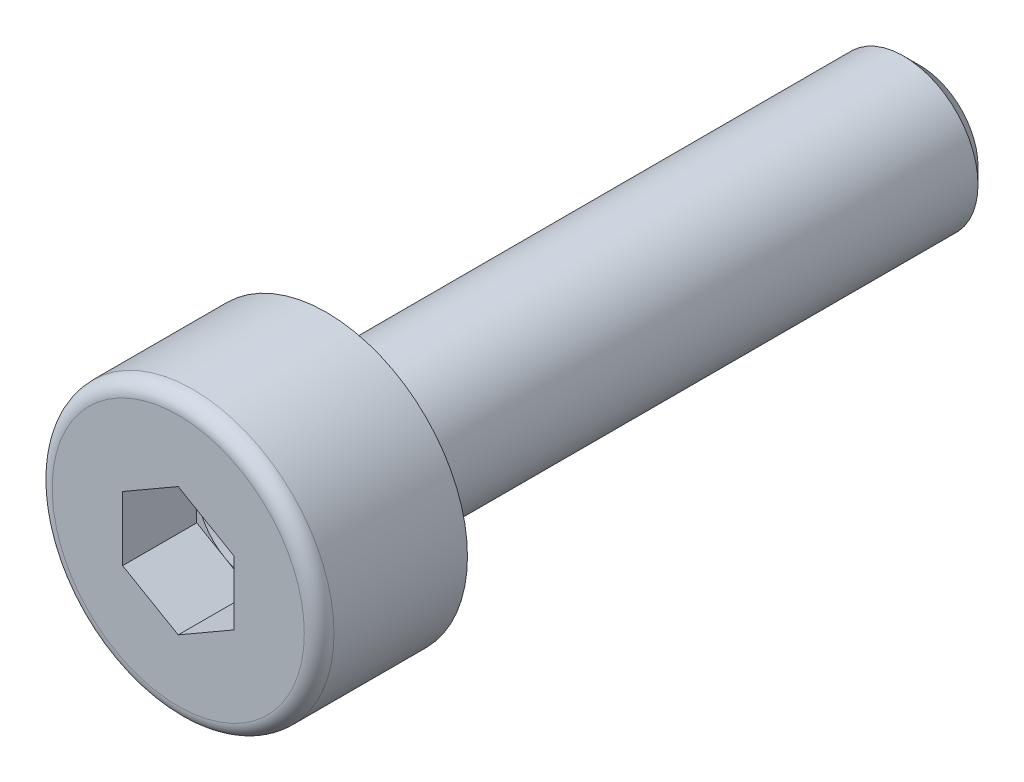
ISO-10303-21;
HEADER;
FILE_DESCRIPTION(('STEP AP214'),'2;1');
FILE_NAME('part.step','',(''),(''),'','','');
FILE_SCHEMA(('AUTOMOTIVE_DESIGN { 1 0 10303 214 1 1 1 1 }'));
ENDSEC;
DATA;
#1=APPLICATION_CONTEXT('core data for automotive mechanical design processes');
#2=APPLICATION_PROTOCOL_DEFINITION('international standard','automotive_design',2000,#1);
#3=PRODUCT_CONTEXT('',#1,'mechanical');
#4=PRODUCT('Part','Part','',(#3));
#5=PRODUCT_RELATED_PRODUCT_CATEGORY('part','',(#4));
#6=PRODUCT_DEFINITION_FORMATION('','',#4);
#7=PRODUCT_DEFINITION_CONTEXT('part definition',#1,'design');
#8=PRODUCT_DEFINITION('design','',#6,#7);
#9=PRODUCT_DEFINITION_SHAPE('','',#8);
#10=(LENGTH_UNIT() NAMED_UNIT(*) SI_UNIT(.MILLI.,.METRE.));
#11=(NAMED_UNIT(*) PLANE_ANGLE_UNIT() SI_UNIT($,.RADIAN.));
#12=(NAMED_UNIT(*) SI_UNIT($,.STERADIAN.) SOLID_ANGLE_UNIT());
#13=UNCERTAINTY_MEASURE_WITH_UNIT(LENGTH_MEASURE(1.E-05),#10,'distance_accuracy_value','');
#14=(GEOMETRIC_REPRESENTATION_CONTEXT(3) GLOBAL_UNCERTAINTY_ASSIGNED_CONTEXT((#13)) GLOBAL_UNIT_ASSIGNED_CONTEXT((#10,
#11,#12)) REPRESENTATION_CONTEXT('',''));
#15=CARTESIAN_POINT('',(0.,0.,0.));
#16=DIRECTION('',(0.,0.,1.));
#17=DIRECTION('',(1.,0.,0.));
#18=AXIS2_PLACEMENT_3D('',#15,#16,#17);
#19=CARTESIAN_POINT('',(0.,0.,-1.));
#20=DIRECTION('',(0.,0.,1.));
#21=DIRECTION('',(1.,0.,0.));
#22=AXIS2_PLACEMENT_3D('',#19,#20,#21);
#23=PLANE('',#22);
#24=DIRECTION('',(0.,1.,0.));
#25=VECTOR('',#24,1.);
#26=CARTESIAN_POINT('',(-0.75,0.094096357056681,-1.));
#27=LINE('',#26,#25);
#28=CARTESIAN_POINT('',(-0.75,0.,-1.));
#29=VERTEX_POINT('',#28);
#30=CARTESIAN_POINT('',(-0.75,0.433012701892219,-1.));
#31=VERTEX_POINT('',#30);
#32=EDGE_CURVE('E289',#29,#31,#27,.T.);
#33=ORIENTED_EDGE('',*,*,#32,.F.);
#34=CARTESIAN_POINT('',(0.,0.,-1.));
#35=DIRECTION('',(0.,0.,-1.));
#36=DIRECTION('',(-1.,0.,0.));
#37=AXIS2_PLACEMENT_3D('',#34,#35,#36);
#38=CIRCLE('',#37,0.75);
#39=CARTESIAN_POINT('',(-0.375,0.649519052838329,-1.));
#40=VERTEX_POINT('',#39);
#41=EDGE_CURVE('E38',#29,#40,#38,.T.);
#42=ORIENTED_EDGE('',*,*,#41,.T.);
#43=DIRECTION('',(0.866025403784439,0.5,0.));
#44=VECTOR('',#43,1.);
#45=CARTESIAN_POINT('',(-0.367562637900043,0.6538130158488,-1.));
#46=LINE('',#45,#44);
#47=EDGE_CURVE('E290',#31,#40,#46,.T.);
#48=ORIENTED_EDGE('',*,*,#47,.F.);
#49=EDGE_LOOP('',(#33,#42,#48));
#50=FACE_BOUND('',#49,.T.);
#51=ADVANCED_FACE('F17',(#50),#23,.T.);
#52=CARTESIAN_POINT('',(0.,0.866025403784439,-1.));
#53=VERTEX_POINT('',#52);
#54=EDGE_CURVE('E294',#40,#53,#46,.T.);
#55=ORIENTED_EDGE('',*,*,#54,.F.);
#56=CARTESIAN_POINT('',(0.375,0.649519052838329,-1.));
#57=VERTEX_POINT('',#56);
#58=EDGE_CURVE('E305',#40,#57,#38,.T.);
#59=ORIENTED_EDGE('',*,*,#58,.T.);
#60=DIRECTION('',(0.866025403784439,-0.5,0.));
#61=VECTOR('',#60,1.);
#62=CARTESIAN_POINT('',(0.421958339069536,0.622407643135835,-1.));
#63=LINE('',#62,#61);
#64=EDGE_CURVE('E295',#53,#57,#63,.T.);
#65=ORIENTED_EDGE('',*,*,#64,.F.);
#66=EDGE_LOOP('',(#55,#59,#65));
#67=FACE_BOUND('',#66,.T.);
#68=ADVANCED_FACE('F134',(#67),#23,.T.);
#69=CARTESIAN_POINT('',(0.75,0.43301270189222,-1.));
#70=VERTEX_POINT('',#69);
#71=EDGE_CURVE('E299',#57,#70,#63,.T.);
#72=ORIENTED_EDGE('',*,*,#71,.F.);
#73=CARTESIAN_POINT('',(0.75,0.,-1.));
#74=VERTEX_POINT('',#73);
#75=EDGE_CURVE('E313',#57,#74,#38,.T.);
#76=ORIENTED_EDGE('',*,*,#75,.T.);
#77=DIRECTION('',(0.,-1.,0.));
#78=VECTOR('',#77,1.);
#79=CARTESIAN_POINT('',(0.75,-0.146115026256323,-1.));
#80=LINE('',#79,#78);
#81=EDGE_CURVE('E300',#70,#74,#80,.T.);
#82=ORIENTED_EDGE('',*,*,#81,.F.);
#83=EDGE_LOOP('',(#72,#76,#82));
#84=FACE_BOUND('',#83,.T.);
#85=ADVANCED_FACE('F139',(#84),#23,.T.);
#86=CARTESIAN_POINT('',(0.75,-0.43301270189222,-1.));
#87=VERTEX_POINT('',#86);
#88=EDGE_CURVE('E257',#74,#87,#80,.T.);
#89=ORIENTED_EDGE('',*,*,#88,.F.);
#90=CARTESIAN_POINT('',(0.375,-0.649519052838329,-1.));
#91=VERTEX_POINT('',#90);
#92=EDGE_CURVE('E321',#74,#91,#38,.T.);
#93=ORIENTED_EDGE('',*,*,#92,.T.);
#94=DIRECTION('',(-0.866025403784439,-0.5,0.));
#95=VECTOR('',#94,1.);
#96=CARTESIAN_POINT('',(0.346250214161918,-0.66611774943109,-1.));
#97=LINE('',#96,#95);
#98=EDGE_CURVE('E252',#87,#91,#97,.T.);
#99=ORIENTED_EDGE('',*,*,#98,.F.);
#100=EDGE_LOOP('',(#89,#93,#99));
#101=FACE_BOUND('',#100,.T.);
#102=ADVANCED_FACE('F338',(#101),#23,.T.);
#103=CARTESIAN_POINT('',(0.,-0.866025403784439,-1.));
#104=VERTEX_POINT('',#103);
#105=EDGE_CURVE('E279',#91,#104,#97,.T.);
#106=ORIENTED_EDGE('',*,*,#105,.F.);
#107=CARTESIAN_POINT('',(-0.375,-0.649519052838329,-1.));
#108=VERTEX_POINT('',#107);
#109=EDGE_CURVE('E314',#91,#108,#38,.T.);
#110=ORIENTED_EDGE('',*,*,#109,.T.);
#111=DIRECTION('',(-0.866025403784439,0.5,0.));
#112=VECTOR('',#111,1.);
#113=CARTESIAN_POINT('',(-0.0688822646431522,-0.826256209750324,-1.));
#114=LINE('',#113,#112);
#115=EDGE_CURVE('E280',#104,#108,#114,.T.);
#116=ORIENTED_EDGE('',*,*,#115,.F.);
#117=EDGE_LOOP('',(#106,#110,#116));
#118=FACE_BOUND('',#117,.T.);
#119=ADVANCED_FACE('F132',(#118),#23,.T.);
#120=CARTESIAN_POINT('',(-1.10172582585694,0.,0.));
#121=DIRECTION('',(0.,0.,-1.));
#122=DIRECTION('',(-1.,0.,0.));
#123=AXIS2_PLACEMENT_3D('',#120,#121,#122);
#124=PLANE('',#123);
#125=CARTESIAN_POINT('',(0.,0.,0.));
#126=DIRECTION('',(0.,0.,1.));
#127=DIRECTION('',(1.,0.,0.));
#128=AXIS2_PLACEMENT_3D('',#125,#126,#127);
#129=CIRCLE('',#128,1.7);
#130=CARTESIAN_POINT('',(1.7,0.,0.));
#131=VERTEX_POINT('',#130);
#132=EDGE_CURVE('E222',#131,#131,#129,.T.);
#133=ORIENTED_EDGE('',*,*,#132,.T.);
#134=EDGE_LOOP('',(#133));
#135=FACE_BOUND('',#134,.T.);
#136=DIRECTION('',(0.,-1.,0.));
#137=VECTOR('',#136,1.);
#138=CARTESIAN_POINT('',(0.75,-0.146115026256323,0.));
#139=LINE('',#138,#137);
#140=CARTESIAN_POINT('',(0.75,0.43301270189222,0.));
#141=VERTEX_POINT('',#140);
#142=CARTESIAN_POINT('',(0.75,-0.43301270189222,0.));
#143=VERTEX_POINT('',#142);
#144=EDGE_CURVE('E272',#141,#143,#139,.T.);
#145=ORIENTED_EDGE('',*,*,#144,.T.);
#146=DIRECTION('',(-0.866025403784439,-0.5,0.));
#147=VECTOR('',#146,1.);
#148=CARTESIAN_POINT('',(0.346250214161918,-0.66611774943109,0.));
#149=LINE('',#148,#147);
#150=CARTESIAN_POINT('',(0.,-0.866025403784439,0.));
#151=VERTEX_POINT('',#150);
#152=EDGE_CURVE('E253',#143,#151,#149,.T.);
#153=ORIENTED_EDGE('',*,*,#152,.T.);
#154=DIRECTION('',(-0.866025403784439,0.5,0.));
#155=VECTOR('',#154,1.);
#156=CARTESIAN_POINT('',(-0.0688822646431522,-0.826256209750324,0.));
#157=LINE('',#156,#155);
#158=CARTESIAN_POINT('',(-0.75,-0.43301270189222,0.));
#159=VERTEX_POINT('',#158);
#160=EDGE_CURVE('E50',#151,#159,#157,.T.);
#161=ORIENTED_EDGE('',*,*,#160,.T.);
#162=DIRECTION('',(0.,1.,0.));
#163=VECTOR('',#162,1.);
#164=CARTESIAN_POINT('',(-0.75,0.094096357056681,0.));
#165=LINE('',#164,#163);
#166=CARTESIAN_POINT('',(-0.75,0.433012701892219,0.));
#167=VERTEX_POINT('',#166);
#168=EDGE_CURVE('E260',#159,#167,#165,.T.);
#169=ORIENTED_EDGE('',*,*,#168,.T.);
#170=DIRECTION('',(0.866025403784439,0.5,0.));
#171=VECTOR('',#170,1.);
#172=CARTESIAN_POINT('',(-0.367562637900043,0.6538130158488,0.));
#173=LINE('',#172,#171);
#174=CARTESIAN_POINT('',(0.,0.866025403784439,0.));
#175=VERTEX_POINT('',#174);
#176=EDGE_CURVE('E264',#167,#175,#173,.T.);
#177=ORIENTED_EDGE('',*,*,#176,.T.);
#178=DIRECTION('',(0.866025403784439,-0.5,0.));
#179=VECTOR('',#178,1.);
#180=CARTESIAN_POINT('',(0.421958339069536,0.622407643135835,0.));
#181=LINE('',#180,#179);
#182=EDGE_CURVE('E268',#175,#141,#181,.T.);
#183=ORIENTED_EDGE('',*,*,#182,.T.);
#184=EDGE_LOOP('',(#145,#153,#161,#169,#177,#183));
#185=FACE_BOUND('',#184,.T.);
#186=ADVANCED_FACE('F184',(#135,#185),#124,.F.);
#187=CARTESIAN_POINT('',(0.,0.,-0.2));
#188=DIRECTION('',(0.,0.,1.));
#189=DIRECTION('',(1.,0.,0.));
#190=AXIS2_PLACEMENT_3D('',#187,#188,#189);
#191=TOROIDAL_SURFACE('',#190,1.7,0.2);
#192=CARTESIAN_POINT('',(0.,0.,-0.2));
#193=DIRECTION('',(0.,0.,1.));
#194=DIRECTION('',(1.,0.,0.));
#195=AXIS2_PLACEMENT_3D('',#192,#193,#194);
#196=CIRCLE('',#195,1.9);
#197=CARTESIAN_POINT('',(1.9,0.,-0.2));
#198=VERTEX_POINT('',#197);
#199=EDGE_CURVE('E226',#198,#198,#196,.T.);
#200=ORIENTED_EDGE('',*,*,#199,.T.);
#201=EDGE_LOOP('',(#200));
#202=FACE_BOUND('',#201,.T.);
#203=ORIENTED_EDGE('',*,*,#132,.F.);
#204=EDGE_LOOP('',(#203));
#205=FACE_BOUND('',#204,.T.);
#206=ADVANCED_FACE('F180',(#202,#205),#191,.T.);
#207=CARTESIAN_POINT('',(0.,0.,-5.));
#208=DIRECTION('',(0.,0.,1.));
#209=DIRECTION('',(1.,0.,0.));
#210=AXIS2_PLACEMENT_3D('',#207,#208,#209);
#211=CYLINDRICAL_SURFACE('',#210,1.9);
#212=ORIENTED_EDGE('',*,*,#199,.F.);
#213=EDGE_LOOP('',(#212));
#214=FACE_BOUND('',#213,.T.);
#215=CARTESIAN_POINT('',(0.,0.,-2.));
#216=DIRECTION('',(0.,0.,1.));
#217=DIRECTION('',(1.,0.,0.));
#218=AXIS2_PLACEMENT_3D('',#215,#216,#217);
#219=CIRCLE('',#218,1.9);
#220=CARTESIAN_POINT('',(1.9,0.,-2.));
#221=VERTEX_POINT('',#220);
#222=EDGE_CURVE('E230',#221,#221,#219,.T.);
#223=ORIENTED_EDGE('',*,*,#222,.T.);
#224=EDGE_LOOP('',(#223));
#225=FACE_BOUND('',#224,.T.);
#226=ADVANCED_FACE('F176',(#214,#225),#211,.T.);
#227=CARTESIAN_POINT('',(-1.61056634651914,0.,-2.));
#228=DIRECTION('',(0.,0.,1.));
#229=DIRECTION('',(1.,0.,0.));
#230=AXIS2_PLACEMENT_3D('',#227,#228,#229);
#231=PLANE('',#230);
#232=CARTESIAN_POINT('',(0.,0.,-2.));
#233=DIRECTION('',(0.,0.,1.));
#234=DIRECTION('',(1.,0.,0.));
#235=AXIS2_PLACEMENT_3D('',#232,#233,#234);
#236=CIRCLE('',#235,1.35719460543127);
#237=CARTESIAN_POINT('',(1.35719460543127,0.,-2.));
#238=VERTEX_POINT('',#237);
#239=EDGE_CURVE('E204',#238,#238,#236,.T.);
#240=ORIENTED_EDGE('',*,*,#239,.T.);
#241=EDGE_LOOP('',(#240));
#242=FACE_BOUND('',#241,.T.);
#243=ORIENTED_EDGE('',*,*,#222,.F.);
#244=EDGE_LOOP('',(#243));
#245=FACE_BOUND('',#244,.T.);
#246=ADVANCED_FACE('F172',(#242,#245),#231,.F.);
#247=CARTESIAN_POINT('',(0.,0.,-5.));
#248=DIRECTION('',(0.,0.,1.));
#249=DIRECTION('',(1.,0.,0.));
#250=AXIS2_PLACEMENT_3D('',#247,#248,#249);
#251=CYLINDRICAL_SURFACE('',#250,1.);
#252=CARTESIAN_POINT('',(0.,0.,-9.78349365));
#253=DIRECTION('',(0.,0.,1.));
#254=DIRECTION('',(1.,0.,0.));
#255=AXIS2_PLACEMENT_3D('',#252,#253,#254);
#256=CIRCLE('',#255,1.);
#257=CARTESIAN_POINT('',(1.,0.,-9.78349365));
#258=VERTEX_POINT('',#257);
#259=EDGE_CURVE('E26',#258,#258,#256,.T.);
#260=ORIENTED_EDGE('',*,*,#259,.T.);
#261=EDGE_LOOP('',(#260));
#262=FACE_BOUND('',#261,.T.);
#263=CARTESIAN_POINT('',(0.,0.,-2.53723082923316));
#264=DIRECTION('',(0.,0.,-1.));
#265=DIRECTION('',(-1.,0.,0.));
#266=AXIS2_PLACEMENT_3D('',#263,#264,#265);
#267=CIRCLE('',#266,1.);
#268=CARTESIAN_POINT('',(-1.,0.,-2.53723082923316));
#269=VERTEX_POINT('',#268);
#270=EDGE_CURVE('E218',#269,#269,#267,.T.);
#271=ORIENTED_EDGE('',*,*,#270,.T.);
#272=EDGE_LOOP('',(#271));
#273=FACE_BOUND('',#272,.T.);
#274=ADVANCED_FACE('F168',(#262,#273),#251,.T.);
#275=CARTESIAN_POINT('',(-0.508840520662193,0.,-10.));
#276=DIRECTION('',(0.,0.,1.));
#277=DIRECTION('',(1.,0.,0.));
#278=AXIS2_PLACEMENT_3D('',#275,#276,#277);
#279=PLANE('',#278);
#280=CARTESIAN_POINT('',(0.,0.,-10.));
#281=DIRECTION('',(0.,0.,1.));
#282=DIRECTION('',(1.,0.,0.));
#283=AXIS2_PLACEMENT_3D('',#280,#281,#282);
#284=CIRCLE('',#283,0.783493649999998);
#285=CARTESIAN_POINT('',(0.783493649999998,0.,-10.));
#286=VERTEX_POINT('',#285);
#287=EDGE_CURVE('E11',#286,#286,#284,.F.);
#288=ORIENTED_EDGE('',*,*,#287,.T.);
#289=EDGE_LOOP('',(#288));
#290=FACE_BOUND('',#289,.T.);
#291=ADVANCED_FACE('F164',(#290),#279,.F.);
#292=CARTESIAN_POINT('',(0.75,-0.146115026256323,-1.));
#293=DIRECTION('',(-1.,0.,0.));
#294=DIRECTION('',(0.,-1.,0.));
#295=AXIS2_PLACEMENT_3D('',#292,#293,#294);
#296=PLANE('',#295);
#297=ORIENTED_EDGE('',*,*,#144,.F.);
#298=DIRECTION('',(0.,0.,1.));
#299=VECTOR('',#298,1.);
#300=CARTESIAN_POINT('',(0.75,0.43301270189222,-1.));
#301=LINE('',#300,#299);
#302=EDGE_CURVE('E234',#70,#141,#301,.T.);
#303=ORIENTED_EDGE('',*,*,#302,.F.);
#304=ORIENTED_EDGE('',*,*,#81,.T.);
#305=ORIENTED_EDGE('',*,*,#88,.T.);
#306=DIRECTION('',(0.,0.,1.));
#307=VECTOR('',#306,1.);
#308=CARTESIAN_POINT('',(0.75,-0.43301270189222,-1.));
#309=LINE('',#308,#307);
#310=EDGE_CURVE('E249',#87,#143,#309,.T.);
#311=ORIENTED_EDGE('',*,*,#310,.T.);
#312=EDGE_LOOP('',(#297,#303,#304,#305,#311));
#313=FACE_BOUND('',#312,.T.);
#314=ADVANCED_FACE('F160',(#313),#296,.T.);
#315=CARTESIAN_POINT('',(0.421958339069536,0.622407643135835,-1.));
#316=DIRECTION('',(-0.5,-0.866025403784439,0.));
#317=DIRECTION('',(0.866025403784439,-0.5,0.));
#318=AXIS2_PLACEMENT_3D('',#315,#316,#317);
#319=PLANE('',#318);
#320=ORIENTED_EDGE('',*,*,#182,.F.);
#321=DIRECTION('',(0.,0.,1.));
#322=VECTOR('',#321,1.);
#323=CARTESIAN_POINT('',(0.,0.866025403784439,-1.));
#324=LINE('',#323,#322);
#325=EDGE_CURVE('E237',#53,#175,#324,.T.);
#326=ORIENTED_EDGE('',*,*,#325,.F.);
#327=ORIENTED_EDGE('',*,*,#64,.T.);
#328=ORIENTED_EDGE('',*,*,#71,.T.);
#329=ORIENTED_EDGE('',*,*,#302,.T.);
#330=EDGE_LOOP('',(#320,#326,#327,#328,#329));
#331=FACE_BOUND('',#330,.T.);
#332=ADVANCED_FACE('F156',(#331),#319,.T.);
#333=CARTESIAN_POINT('',(-0.367562637900043,0.6538130158488,-1.));
#334=DIRECTION('',(0.5,-0.866025403784439,0.));
#335=DIRECTION('',(0.866025403784439,0.5,0.));
#336=AXIS2_PLACEMENT_3D('',#333,#334,#335);
#337=PLANE('',#336);
#338=ORIENTED_EDGE('',*,*,#176,.F.);
#339=DIRECTION('',(0.,0.,1.));
#340=VECTOR('',#339,1.);
#341=CARTESIAN_POINT('',(-0.75,0.433012701892219,-1.));
#342=LINE('',#341,#340);
#343=EDGE_CURVE('E240',#31,#167,#342,.T.);
#344=ORIENTED_EDGE('',*,*,#343,.F.);
#345=ORIENTED_EDGE('',*,*,#47,.T.);
#346=ORIENTED_EDGE('',*,*,#54,.T.);
#347=ORIENTED_EDGE('',*,*,#325,.T.);
#348=EDGE_LOOP('',(#338,#344,#345,#346,#347));
#349=FACE_BOUND('',#348,.T.);
#350=ADVANCED_FACE('F152',(#349),#337,.T.);
#351=CARTESIAN_POINT('',(-0.75,0.094096357056681,-1.));
#352=DIRECTION('',(1.,0.,0.));
#353=DIRECTION('',(0.,0.,-1.));
#354=AXIS2_PLACEMENT_3D('',#351,#352,#353);
#355=PLANE('',#354);
#356=ORIENTED_EDGE('',*,*,#168,.F.);
#357=DIRECTION('',(0.,0.,1.));
#358=VECTOR('',#357,1.);
#359=CARTESIAN_POINT('',(-0.75,-0.43301270189222,-1.));
#360=LINE('',#359,#358);
#361=CARTESIAN_POINT('',(-0.75,-0.43301270189222,-1.));
#362=VERTEX_POINT('',#361);
#363=EDGE_CURVE('E243',#362,#159,#360,.T.);
#364=ORIENTED_EDGE('',*,*,#363,.F.);
#365=EDGE_CURVE('E285',#362,#29,#27,.T.);
#366=ORIENTED_EDGE('',*,*,#365,.T.);
#367=ORIENTED_EDGE('',*,*,#32,.T.);
#368=ORIENTED_EDGE('',*,*,#343,.T.);
#369=EDGE_LOOP('',(#356,#364,#366,#367,#368));
#370=FACE_BOUND('',#369,.T.);
#371=ADVANCED_FACE('F149',(#370),#355,.T.);
#372=CARTESIAN_POINT('',(-0.0688822646431522,-0.826256209750324,-1.));
#373=DIRECTION('',(0.5,0.866025403784439,0.));
#374=DIRECTION('',(-0.866025403784439,0.5,0.));
#375=AXIS2_PLACEMENT_3D('',#372,#373,#374);
#376=PLANE('',#375);
#377=ORIENTED_EDGE('',*,*,#160,.F.);
#378=DIRECTION('',(0.,0.,1.));
#379=VECTOR('',#378,1.);
#380=CARTESIAN_POINT('',(0.,-0.866025403784439,-1.));
#381=LINE('',#380,#379);
#382=EDGE_CURVE('E246',#104,#151,#381,.T.);
#383=ORIENTED_EDGE('',*,*,#382,.F.);
#384=ORIENTED_EDGE('',*,*,#115,.T.);
#385=EDGE_CURVE('E284',#108,#362,#114,.T.);
#386=ORIENTED_EDGE('',*,*,#385,.T.);
#387=ORIENTED_EDGE('',*,*,#363,.T.);
#388=EDGE_LOOP('',(#377,#383,#384,#386,#387));
#389=FACE_BOUND('',#388,.T.);
#390=ADVANCED_FACE('F145',(#389),#376,.T.);
#391=CARTESIAN_POINT('',(0.346250214161918,-0.66611774943109,-1.));
#392=DIRECTION('',(-0.5,0.866025403784439,0.));
#393=DIRECTION('',(-0.866025403784439,-0.5,0.));
#394=AXIS2_PLACEMENT_3D('',#391,#392,#393);
#395=PLANE('',#394);
#396=ORIENTED_EDGE('',*,*,#152,.F.);
#397=ORIENTED_EDGE('',*,*,#310,.F.);
#398=ORIENTED_EDGE('',*,*,#98,.T.);
#399=ORIENTED_EDGE('',*,*,#105,.T.);
#400=ORIENTED_EDGE('',*,*,#382,.T.);
#401=EDGE_LOOP('',(#396,#397,#398,#399,#400));
#402=FACE_BOUND('',#401,.T.);
#403=ADVANCED_FACE('F129',(#402),#395,.T.);
#404=ORIENTED_EDGE('',*,*,#385,.F.);
#405=EDGE_CURVE('E306',#108,#29,#38,.T.);
#406=ORIENTED_EDGE('',*,*,#405,.T.);
#407=ORIENTED_EDGE('',*,*,#365,.F.);
#408=EDGE_LOOP('',(#404,#406,#407));
#409=FACE_BOUND('',#408,.T.);
#410=ADVANCED_FACE('F119',(#409),#23,.T.);
#411=CARTESIAN_POINT('',(0.,0.,-1.));
#412=DIRECTION('',(0.,0.,1.));
#413=DIRECTION('',(1.,0.,0.));
#414=AXIS2_PLACEMENT_3D('',#411,#412,#413);
#415=CONICAL_SURFACE('',#414,0.75,1.22173047639603);
#416=CARTESIAN_POINT('',(0.,0.,-1.27297767569965));
#417=VERTEX_POINT('',#416);
#418=VERTEX_LOOP('',#417);
#419=FACE_BOUND('',#418,.T.);
#420=ORIENTED_EDGE('',*,*,#41,.F.);
#421=ORIENTED_EDGE('',*,*,#405,.F.);
#422=ORIENTED_EDGE('',*,*,#109,.F.);
#423=ORIENTED_EDGE('',*,*,#92,.F.);
#424=ORIENTED_EDGE('',*,*,#75,.F.);
#425=ORIENTED_EDGE('',*,*,#58,.F.);
#426=EDGE_LOOP('',(#420,#421,#422,#423,#424,#425));
#427=FACE_BOUND('',#426,.T.);
#428=ADVANCED_FACE('F116',(#419,#427),#415,.F.);
#429=CARTESIAN_POINT('',(0.,0.,-2.));
#430=DIRECTION('',(0.,0.,1.));
#431=DIRECTION('',(1.,0.,0.));
#432=AXIS2_PLACEMENT_3D('',#429,#430,#431);
#433=CONICAL_SURFACE('',#432,1.3,0.531724067258806);
#434=CARTESIAN_POINT('',(0.,0.,-2.48652881657682));
#435=DIRECTION('',(0.,0.,1.));
#436=DIRECTION('',(1.,0.,0.));
#437=AXIS2_PLACEMENT_3D('',#434,#435,#436);
#438=CIRCLE('',#437,1.01380657848422);
#439=CARTESIAN_POINT('',(1.01380657848422,0.,-2.48652881657682));
#440=VERTEX_POINT('',#439);
#441=EDGE_CURVE('E206',#440,#440,#438,.T.);
#442=ORIENTED_EDGE('',*,*,#441,.T.);
#443=EDGE_LOOP('',(#442));
#444=FACE_BOUND('',#443,.T.);
#445=CARTESIAN_POINT('',(0.,0.,-2.04929798734366));
#446=DIRECTION('',(0.,0.,1.));
#447=DIRECTION('',(1.,0.,0.));
#448=AXIS2_PLACEMENT_3D('',#445,#446,#447);
#449=CIRCLE('',#448,1.27100118391549);
#450=CARTESIAN_POINT('',(1.27100118391549,0.,-2.04929798734366));
#451=VERTEX_POINT('',#450);
#452=EDGE_CURVE('E201',#451,#451,#449,.F.);
#453=ORIENTED_EDGE('',*,*,#452,.T.);
#454=EDGE_LOOP('',(#453));
#455=FACE_BOUND('',#454,.T.);
#456=ADVANCED_FACE('F118',(#444,#455),#433,.T.);
#457=CARTESIAN_POINT('',(0.,0.,-2.53723082923316));
#458=DIRECTION('',(0.,0.,-1.));
#459=DIRECTION('',(-1.,0.,0.));
#460=AXIS2_PLACEMENT_3D('',#457,#458,#459);
#461=TOROIDAL_SURFACE('',#460,1.1,0.1);
#462=ORIENTED_EDGE('',*,*,#441,.F.);
#463=EDGE_LOOP('',(#462));
#464=FACE_BOUND('',#463,.T.);
#465=ORIENTED_EDGE('',*,*,#270,.F.);
#466=EDGE_LOOP('',(#465));
#467=FACE_BOUND('',#466,.T.);
#468=ADVANCED_FACE('F126',(#464,#467),#461,.F.);
#469=CARTESIAN_POINT('',(0.,0.,-2.1));
#470=DIRECTION('',(0.,0.,1.));
#471=DIRECTION('',(1.,0.,0.));
#472=AXIS2_PLACEMENT_3D('',#469,#470,#471);
#473=TOROIDAL_SURFACE('',#472,1.35719460543127,0.1);
#474=ORIENTED_EDGE('',*,*,#452,.F.);
#475=EDGE_LOOP('',(#474));
#476=FACE_BOUND('',#475,.T.);
#477=ORIENTED_EDGE('',*,*,#239,.F.);
#478=EDGE_LOOP('',(#477));
#479=FACE_BOUND('',#478,.T.);
#480=ADVANCED_FACE('F190',(#476,#479),#473,.F.);
#481=CARTESIAN_POINT('',(0.,0.,-9.78349365));
#482=DIRECTION('',(0.,0.,1.));
#483=DIRECTION('',(1.,0.,0.));
#484=AXIS2_PLACEMENT_3D('',#481,#482,#483);
#485=CONICAL_SURFACE('',#484,1.,0.78539816339745);
#486=ORIENTED_EDGE('',*,*,#287,.F.);
#487=EDGE_LOOP('',(#486));
#488=FACE_BOUND('',#487,.T.);
#489=ORIENTED_EDGE('',*,*,#259,.F.);
#490=EDGE_LOOP('',(#489));
#491=FACE_BOUND('',#490,.T.);
#492=ADVANCED_FACE('F19',(#488,#491),#485,.T.);
#493=CLOSED_SHELL('',(#51,#68,#85,#102,#119,#186,#206,#226,#246,#274,#291,#314,#332,#350,#371,
#390,#403,#410,#428,#456,#468,#480,#492));
#494=MANIFOLD_SOLID_BREP('B1',#493);
#495=ADVANCED_BREP_SHAPE_REPRESENTATION('',(#18,#494),#14);
#496=SHAPE_DEFINITION_REPRESENTATION(#9,#495);
ENDSEC;
END-ISO-10303-21;
